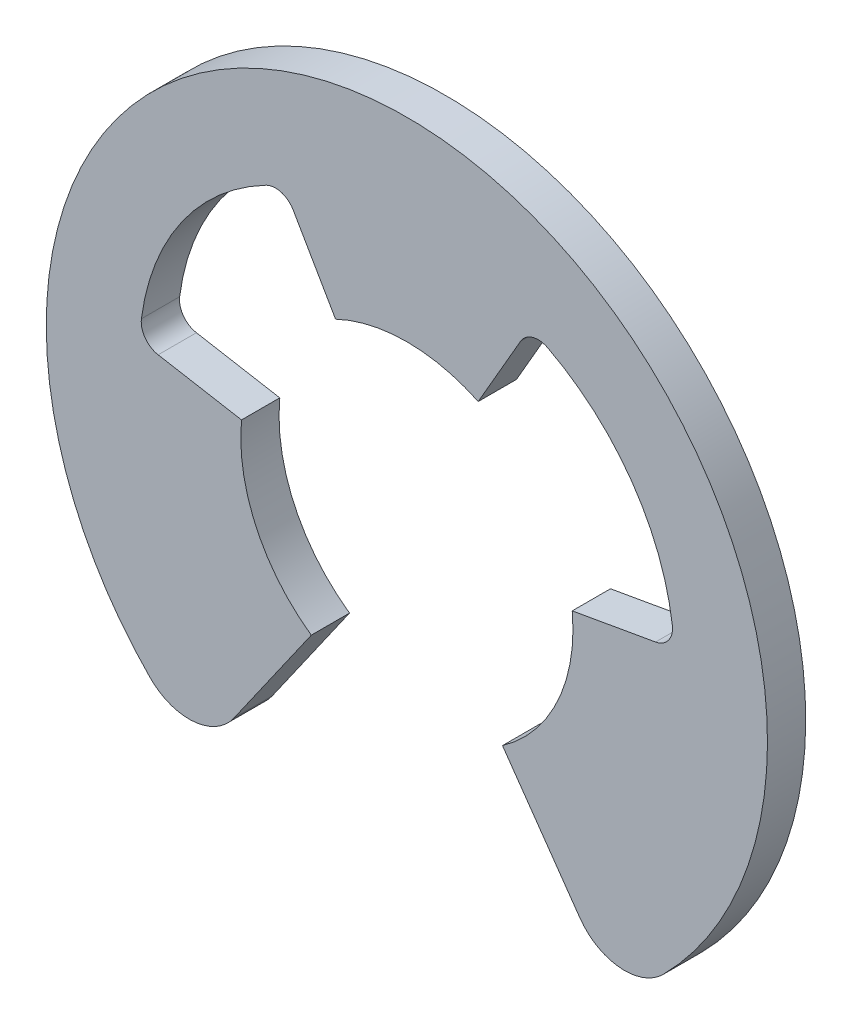
ISO-10303-21;
HEADER;
FILE_DESCRIPTION(('STEP AP214'),'2;1');
FILE_NAME('part.step','',(''),(''),'','','');
FILE_SCHEMA(('AUTOMOTIVE_DESIGN { 1 0 10303 214 1 1 1 1 }'));
ENDSEC;
DATA;
#1=APPLICATION_CONTEXT('core data for automotive mechanical design processes');
#2=APPLICATION_PROTOCOL_DEFINITION('international standard','automotive_design',2000,#1);
#3=PRODUCT_CONTEXT('',#1,'mechanical');
#4=PRODUCT('Part','Part','',(#3));
#5=PRODUCT_RELATED_PRODUCT_CATEGORY('part','',(#4));
#6=PRODUCT_DEFINITION_FORMATION('','',#4);
#7=PRODUCT_DEFINITION_CONTEXT('part definition',#1,'design');
#8=PRODUCT_DEFINITION('design','',#6,#7);
#9=PRODUCT_DEFINITION_SHAPE('','',#8);
#10=(LENGTH_UNIT() NAMED_UNIT(*) SI_UNIT(.MILLI.,.METRE.));
#11=(NAMED_UNIT(*) PLANE_ANGLE_UNIT() SI_UNIT($,.RADIAN.));
#12=(NAMED_UNIT(*) SI_UNIT($,.STERADIAN.) SOLID_ANGLE_UNIT());
#13=UNCERTAINTY_MEASURE_WITH_UNIT(LENGTH_MEASURE(1.E-05),#10,'distance_accuracy_value','');
#14=(GEOMETRIC_REPRESENTATION_CONTEXT(3) GLOBAL_UNCERTAINTY_ASSIGNED_CONTEXT((#13)) GLOBAL_UNIT_ASSIGNED_CONTEXT((#10,
#11,#12)) REPRESENTATION_CONTEXT('',''));
#15=CARTESIAN_POINT('',(0.,0.,0.));
#16=DIRECTION('',(0.,0.,1.));
#17=DIRECTION('',(1.,0.,0.));
#18=AXIS2_PLACEMENT_3D('',#15,#16,#17);
#19=CARTESIAN_POINT('',(0.,0.950568792696658,-0.4445));
#20=DIRECTION('',(0.,0.,1.));
#21=DIRECTION('',(1.,0.,0.));
#22=AXIS2_PLACEMENT_3D('',#19,#20,#21);
#23=PLANE('',#22);
#24=DIRECTION('',(0.573576436351046,0.819152044288992,0.));
#25=VECTOR('',#24,1.);
#26=CARTESIAN_POINT('',(-4.0207262583221,-5.72507328235155,-0.4445));
#27=LINE('',#26,#25);
#28=CARTESIAN_POINT('',(-4.0207262583221,-5.72507328235155,-0.4445));
#29=VERTEX_POINT('',#28);
#30=CARTESIAN_POINT('',(-2.2225,-3.15694003585751,-0.4445));
#31=VERTEX_POINT('',#30);
#32=EDGE_CURVE('E150',#29,#31,#27,.T.);
#33=ORIENTED_EDGE('',*,*,#32,.F.);
#34=CARTESIAN_POINT('',(-5.06104935456912,-4.99663120818572,-0.4445));
#35=DIRECTION('',(0.,0.,1.));
#36=DIRECTION('',(1.,0.,0.));
#37=AXIS2_PLACEMENT_3D('',#34,#35,#36);
#38=CIRCLE('',#37,1.27);
#39=CARTESIAN_POINT('',(-5.96480816788504,-5.88888678107603,-0.4445));
#40=VERTEX_POINT('',#39);
#41=EDGE_CURVE('E34',#40,#29,#38,.T.);
#42=ORIENTED_EDGE('',*,*,#41,.F.);
#43=CARTESIAN_POINT('',(0.,0.,-0.4445));
#44=DIRECTION('',(0.,0.,1.));
#45=DIRECTION('',(1.,0.,0.));
#46=AXIS2_PLACEMENT_3D('',#43,#44,#45);
#47=CIRCLE('',#46,8.382);
#48=CARTESIAN_POINT('',(5.96480816788504,-5.88888678107603,-0.4445));
#49=VERTEX_POINT('',#48);
#50=EDGE_CURVE('E25',#49,#40,#47,.T.);
#51=ORIENTED_EDGE('',*,*,#50,.F.);
#52=CARTESIAN_POINT('',(5.06104935456912,-4.99663120818572,-0.4445));
#53=DIRECTION('',(0.,0.,1.));
#54=DIRECTION('',(1.,0.,0.));
#55=AXIS2_PLACEMENT_3D('',#52,#53,#54);
#56=CIRCLE('',#55,1.27);
#57=CARTESIAN_POINT('',(4.0207262583221,-5.72507328235155,-0.4445));
#58=VERTEX_POINT('',#57);
#59=EDGE_CURVE('E165',#58,#49,#56,.T.);
#60=ORIENTED_EDGE('',*,*,#59,.F.);
#61=DIRECTION('',(0.573576436351046,-0.819152044288992,0.));
#62=VECTOR('',#61,1.);
#63=CARTESIAN_POINT('',(2.2225,-3.15694003585751,-0.4445));
#64=LINE('',#63,#62);
#65=CARTESIAN_POINT('',(2.2225,-3.15694003585751,-0.4445));
#66=VERTEX_POINT('',#65);
#67=EDGE_CURVE('E168',#66,#58,#64,.T.);
#68=ORIENTED_EDGE('',*,*,#67,.F.);
#69=CARTESIAN_POINT('',(0.,0.,-0.4445));
#70=DIRECTION('',(0.,0.,-1.));
#71=DIRECTION('',(0.,-1.,0.));
#72=AXIS2_PLACEMENT_3D('',#69,#70,#71);
#73=CIRCLE('',#72,3.8608);
#74=CARTESIAN_POINT('',(3.84344734962157,0.365635215326578,-0.4445));
#75=VERTEX_POINT('',#74);
#76=EDGE_CURVE('E175',#75,#66,#73,.T.);
#77=ORIENTED_EDGE('',*,*,#76,.F.);
#78=DIRECTION('',(-0.984807753012208,-0.17364817766693,0.));
#79=VECTOR('',#78,1.);
#80=CARTESIAN_POINT('',(5.78121413777015,0.707315782397956,-0.4445));
#81=LINE('',#80,#79);
#82=CARTESIAN_POINT('',(5.78121413777015,0.707315782397956,-0.4445));
#83=VERTEX_POINT('',#82);
#84=EDGE_CURVE('E181',#83,#75,#81,.T.);
#85=ORIENTED_EDGE('',*,*,#84,.F.);
#86=CARTESIAN_POINT('',(5.69851419315628,1.17633047477002,-0.4445));
#87=DIRECTION('',(0.,0.,-1.));
#88=DIRECTION('',(0.,-1.,0.));
#89=AXIS2_PLACEMENT_3D('',#86,#87,#88);
#90=CIRCLE('',#89,0.476249999999999);
#91=CARTESIAN_POINT('',(6.17073522176454,1.23814764584856,-0.4445));
#92=VERTEX_POINT('',#91);
#93=EDGE_CURVE('E187',#92,#83,#90,.T.);
#94=ORIENTED_EDGE('',*,*,#93,.F.);
#95=CARTESIAN_POINT('',(0.755934093723117,0.529310750814651,-0.4445));
#96=DIRECTION('',(0.,0.,-1.));
#97=DIRECTION('',(0.,-1.,0.));
#98=AXIS2_PLACEMENT_3D('',#95,#96,#97);
#99=CIRCLE('',#98,5.461);
#100=CARTESIAN_POINT('',(3.27399395122,5.37512291742437,-0.4445));
#101=VERTEX_POINT('',#100);
#102=EDGE_CURVE('E193',#101,#92,#99,.T.);
#103=ORIENTED_EDGE('',*,*,#102,.F.);
#104=CARTESIAN_POINT('',(3.05439570783364,4.95252301917352,-0.4445));
#105=DIRECTION('',(0.,0.,-1.));
#106=DIRECTION('',(0.,-1.,0.));
#107=AXIS2_PLACEMENT_3D('',#104,#105,#106);
#108=CIRCLE('',#107,0.476249999999997);
#109=CARTESIAN_POINT('',(2.6419511092813,5.19064801917352,-0.4445));
#110=VERTEX_POINT('',#109);
#111=EDGE_CURVE('E199',#110,#101,#108,.T.);
#112=ORIENTED_EDGE('',*,*,#111,.F.);
#113=DIRECTION('',(0.5,0.866025403784438,0.));
#114=VECTOR('',#113,1.);
#115=CARTESIAN_POINT('',(1.65812112712408,3.48660450406764,-0.4445));
#116=LINE('',#115,#114);
#117=CARTESIAN_POINT('',(1.65812112712408,3.48660450406764,-0.4445));
#118=VERTEX_POINT('',#117);
#119=EDGE_CURVE('E205',#118,#110,#116,.T.);
#120=ORIENTED_EDGE('',*,*,#119,.F.);
#121=CARTESIAN_POINT('',(0.,0.,-0.4445));
#122=DIRECTION('',(0.,0.,-1.));
#123=DIRECTION('',(0.,-1.,0.));
#124=AXIS2_PLACEMENT_3D('',#121,#122,#123);
#125=CIRCLE('',#124,3.8608);
#126=CARTESIAN_POINT('',(-1.65812112712408,3.48660450406764,-0.4445));
#127=VERTEX_POINT('',#126);
#128=EDGE_CURVE('E211',#127,#118,#125,.T.);
#129=ORIENTED_EDGE('',*,*,#128,.F.);
#130=DIRECTION('',(0.5,-0.866025403784438,0.));
#131=VECTOR('',#130,1.);
#132=CARTESIAN_POINT('',(-2.6419511092813,5.19064801917352,-0.4445));
#133=LINE('',#132,#131);
#134=CARTESIAN_POINT('',(-2.6419511092813,5.19064801917352,-0.4445));
#135=VERTEX_POINT('',#134);
#136=EDGE_CURVE('E217',#135,#127,#133,.T.);
#137=ORIENTED_EDGE('',*,*,#136,.F.);
#138=CARTESIAN_POINT('',(-3.05439570783364,4.95252301917352,-0.4445));
#139=DIRECTION('',(0.,0.,-1.));
#140=DIRECTION('',(0.,-1.,0.));
#141=AXIS2_PLACEMENT_3D('',#138,#139,#140);
#142=CIRCLE('',#141,0.476250000000001);
#143=CARTESIAN_POINT('',(-3.27399395122,5.37512291742437,-0.4445));
#144=VERTEX_POINT('',#143);
#145=EDGE_CURVE('E223',#144,#135,#142,.T.);
#146=ORIENTED_EDGE('',*,*,#145,.F.);
#147=CARTESIAN_POINT('',(-0.755934093723116,0.529310750814652,-0.4445));
#148=DIRECTION('',(0.,0.,-1.));
#149=DIRECTION('',(0.,-1.,0.));
#150=AXIS2_PLACEMENT_3D('',#147,#148,#149);
#151=CIRCLE('',#150,5.461);
#152=CARTESIAN_POINT('',(-6.17073522176454,1.23814764584857,-0.4445));
#153=VERTEX_POINT('',#152);
#154=EDGE_CURVE('E229',#153,#144,#151,.T.);
#155=ORIENTED_EDGE('',*,*,#154,.F.);
#156=CARTESIAN_POINT('',(-5.69851419315628,1.17633047477003,-0.4445));
#157=DIRECTION('',(0.,0.,-1.));
#158=DIRECTION('',(0.,-1.,0.));
#159=AXIS2_PLACEMENT_3D('',#156,#157,#158);
#160=CIRCLE('',#159,0.47625);
#161=CARTESIAN_POINT('',(-5.78121413777015,0.707315782397964,-0.4445));
#162=VERTEX_POINT('',#161);
#163=EDGE_CURVE('E235',#162,#153,#160,.T.);
#164=ORIENTED_EDGE('',*,*,#163,.F.);
#165=DIRECTION('',(-0.984807753012208,0.173648177666932,0.));
#166=VECTOR('',#165,1.);
#167=CARTESIAN_POINT('',(-3.84344734962157,0.365635215326582,-0.4445));
#168=LINE('',#167,#166);
#169=CARTESIAN_POINT('',(-3.84344734962157,0.365635215326582,-0.4445));
#170=VERTEX_POINT('',#169);
#171=EDGE_CURVE('E241',#170,#162,#168,.T.);
#172=ORIENTED_EDGE('',*,*,#171,.F.);
#173=CARTESIAN_POINT('',(0.,0.,-0.4445));
#174=DIRECTION('',(0.,0.,-1.));
#175=DIRECTION('',(0.,-1.,0.));
#176=AXIS2_PLACEMENT_3D('',#173,#174,#175);
#177=CIRCLE('',#176,3.8608);
#178=EDGE_CURVE('E246',#31,#170,#177,.T.);
#179=ORIENTED_EDGE('',*,*,#178,.F.);
#180=EDGE_LOOP('',(#33,#42,#51,#60,#68,#77,#85,#94,#103,#112,#120,#129,#137,#146,#155,#164,#172,#179));
#181=FACE_BOUND('',#180,.T.);
#182=ADVANCED_FACE('F15',(#181),#23,.F.);
#183=CARTESIAN_POINT('',(0.,0.,0.));
#184=DIRECTION('',(0.,0.,1.));
#185=DIRECTION('',(1.,0.,0.));
#186=AXIS2_PLACEMENT_3D('',#183,#184,#185);
#187=CYLINDRICAL_SURFACE('',#186,8.382);
#188=CARTESIAN_POINT('',(0.,0.,0.4445));
#189=DIRECTION('',(0.,0.,-1.));
#190=DIRECTION('',(0.,-1.,0.));
#191=AXIS2_PLACEMENT_3D('',#188,#189,#190);
#192=CIRCLE('',#191,8.382);
#193=CARTESIAN_POINT('',(-5.96480816788504,-5.88888678107603,0.4445));
#194=VERTEX_POINT('',#193);
#195=CARTESIAN_POINT('',(5.96480816788504,-5.88888678107603,0.4445));
#196=VERTEX_POINT('',#195);
#197=EDGE_CURVE('E9',#194,#196,#192,.T.);
#198=ORIENTED_EDGE('',*,*,#197,.T.);
#199=DIRECTION('',(0.,0.,1.));
#200=VECTOR('',#199,1.);
#201=CARTESIAN_POINT('',(5.96480816788504,-5.88888678107603,0.));
#202=LINE('',#201,#200);
#203=EDGE_CURVE('E161',#49,#196,#202,.T.);
#204=ORIENTED_EDGE('',*,*,#203,.F.);
#205=ORIENTED_EDGE('',*,*,#50,.T.);
#206=DIRECTION('',(0.,0.,-1.));
#207=VECTOR('',#206,1.);
#208=CARTESIAN_POINT('',(-5.96480816788504,-5.88888678107603,0.));
#209=LINE('',#208,#207);
#210=EDGE_CURVE('E155',#194,#40,#209,.T.);
#211=ORIENTED_EDGE('',*,*,#210,.F.);
#212=EDGE_LOOP('',(#198,#204,#205,#211));
#213=FACE_BOUND('',#212,.T.);
#214=ADVANCED_FACE('F285',(#213),#187,.T.);
#215=CARTESIAN_POINT('',(5.06104935456912,-4.99663120818572,0.));
#216=DIRECTION('',(0.,0.,1.));
#217=DIRECTION('',(1.,0.,0.));
#218=AXIS2_PLACEMENT_3D('',#215,#216,#217);
#219=CYLINDRICAL_SURFACE('',#218,1.27);
#220=CARTESIAN_POINT('',(5.06104935456912,-4.99663120818572,0.4445));
#221=DIRECTION('',(0.,0.,-1.));
#222=DIRECTION('',(0.,-1.,0.));
#223=AXIS2_PLACEMENT_3D('',#220,#221,#222);
#224=CIRCLE('',#223,1.27);
#225=CARTESIAN_POINT('',(4.0207262583221,-5.72507328235155,0.4445));
#226=VERTEX_POINT('',#225);
#227=EDGE_CURVE('E162',#196,#226,#224,.T.);
#228=ORIENTED_EDGE('',*,*,#227,.T.);
#229=DIRECTION('',(0.,0.,1.));
#230=VECTOR('',#229,1.);
#231=CARTESIAN_POINT('',(4.0207262583221,-5.72507328235155,0.));
#232=LINE('',#231,#230);
#233=EDGE_CURVE('E166',#58,#226,#232,.T.);
#234=ORIENTED_EDGE('',*,*,#233,.F.);
#235=ORIENTED_EDGE('',*,*,#59,.T.);
#236=ORIENTED_EDGE('',*,*,#203,.T.);
#237=EDGE_LOOP('',(#228,#234,#235,#236));
#238=FACE_BOUND('',#237,.T.);
#239=ADVANCED_FACE('F290',(#238),#219,.T.);
#240=CARTESIAN_POINT('',(4.0207262583221,-5.72507328235155,0.));
#241=DIRECTION('',(-0.819152044288992,-0.573576436351046,0.));
#242=DIRECTION('',(0.573576436351046,-0.819152044288992,0.));
#243=AXIS2_PLACEMENT_3D('',#240,#241,#242);
#244=PLANE('',#243);
#245=DIRECTION('',(-0.573576436351046,0.819152044288992,0.));
#246=VECTOR('',#245,1.);
#247=CARTESIAN_POINT('',(2.2225,-3.15694003585751,0.4445));
#248=LINE('',#247,#246);
#249=CARTESIAN_POINT('',(2.2225,-3.15694003585751,0.4445));
#250=VERTEX_POINT('',#249);
#251=EDGE_CURVE('E170',#226,#250,#248,.T.);
#252=ORIENTED_EDGE('',*,*,#251,.T.);
#253=DIRECTION('',(0.,0.,1.));
#254=VECTOR('',#253,1.);
#255=CARTESIAN_POINT('',(2.2225,-3.15694003585751,0.));
#256=LINE('',#255,#254);
#257=EDGE_CURVE('E173',#66,#250,#256,.T.);
#258=ORIENTED_EDGE('',*,*,#257,.F.);
#259=ORIENTED_EDGE('',*,*,#67,.T.);
#260=ORIENTED_EDGE('',*,*,#233,.T.);
#261=EDGE_LOOP('',(#252,#258,#259,#260));
#262=FACE_BOUND('',#261,.T.);
#263=ADVANCED_FACE('F294',(#262),#244,.T.);
#264=CARTESIAN_POINT('',(0.,0.,0.));
#265=DIRECTION('',(0.,0.,1.));
#266=DIRECTION('',(1.,0.,0.));
#267=AXIS2_PLACEMENT_3D('',#264,#265,#266);
#268=CYLINDRICAL_SURFACE('',#267,3.8608);
#269=CARTESIAN_POINT('',(0.,0.,0.4445));
#270=DIRECTION('',(0.,0.,1.));
#271=DIRECTION('',(1.,0.,0.));
#272=AXIS2_PLACEMENT_3D('',#269,#270,#271);
#273=CIRCLE('',#272,3.8608);
#274=CARTESIAN_POINT('',(3.84344734962157,0.365635215326578,0.4445));
#275=VERTEX_POINT('',#274);
#276=EDGE_CURVE('E169',#250,#275,#273,.T.);
#277=ORIENTED_EDGE('',*,*,#276,.T.);
#278=DIRECTION('',(0.,0.,1.));
#279=VECTOR('',#278,1.);
#280=CARTESIAN_POINT('',(3.84344734962157,0.365635215326578,0.));
#281=LINE('',#280,#279);
#282=EDGE_CURVE('E179',#75,#275,#281,.T.);
#283=ORIENTED_EDGE('',*,*,#282,.F.);
#284=ORIENTED_EDGE('',*,*,#76,.T.);
#285=ORIENTED_EDGE('',*,*,#257,.T.);
#286=EDGE_LOOP('',(#277,#283,#284,#285));
#287=FACE_BOUND('',#286,.T.);
#288=ADVANCED_FACE('F297',(#287),#268,.F.);
#289=CARTESIAN_POINT('',(3.84344734962157,0.365635215326578,0.));
#290=DIRECTION('',(-0.17364817766693,0.984807753012208,0.));
#291=DIRECTION('',(-0.984807753012208,-0.17364817766693,0.));
#292=AXIS2_PLACEMENT_3D('',#289,#290,#291);
#293=PLANE('',#292);
#294=DIRECTION('',(0.984807753012208,0.17364817766693,0.));
#295=VECTOR('',#294,1.);
#296=CARTESIAN_POINT('',(5.78121413777015,0.707315782397956,0.4445));
#297=LINE('',#296,#295);
#298=CARTESIAN_POINT('',(5.78121413777015,0.707315782397956,0.4445));
#299=VERTEX_POINT('',#298);
#300=EDGE_CURVE('E176',#275,#299,#297,.T.);
#301=ORIENTED_EDGE('',*,*,#300,.T.);
#302=DIRECTION('',(0.,0.,1.));
#303=VECTOR('',#302,1.);
#304=CARTESIAN_POINT('',(5.78121413777015,0.707315782397956,0.));
#305=LINE('',#304,#303);
#306=EDGE_CURVE('E185',#83,#299,#305,.T.);
#307=ORIENTED_EDGE('',*,*,#306,.F.);
#308=ORIENTED_EDGE('',*,*,#84,.T.);
#309=ORIENTED_EDGE('',*,*,#282,.T.);
#310=EDGE_LOOP('',(#301,#307,#308,#309));
#311=FACE_BOUND('',#310,.T.);
#312=ADVANCED_FACE('F299',(#311),#293,.T.);
#313=CARTESIAN_POINT('',(5.69851419315628,1.17633047477002,0.));
#314=DIRECTION('',(0.,0.,1.));
#315=DIRECTION('',(1.,0.,0.));
#316=AXIS2_PLACEMENT_3D('',#313,#314,#315);
#317=CYLINDRICAL_SURFACE('',#316,0.476249999999999);
#318=CARTESIAN_POINT('',(5.69851419315628,1.17633047477002,0.4445));
#319=DIRECTION('',(0.,0.,1.));
#320=DIRECTION('',(1.,0.,0.));
#321=AXIS2_PLACEMENT_3D('',#318,#319,#320);
#322=CIRCLE('',#321,0.476249999999999);
#323=CARTESIAN_POINT('',(6.17073522176454,1.23814764584856,0.4445));
#324=VERTEX_POINT('',#323);
#325=EDGE_CURVE('E182',#299,#324,#322,.T.);
#326=ORIENTED_EDGE('',*,*,#325,.T.);
#327=DIRECTION('',(0.,0.,1.));
#328=VECTOR('',#327,1.);
#329=CARTESIAN_POINT('',(6.17073522176454,1.23814764584856,0.));
#330=LINE('',#329,#328);
#331=EDGE_CURVE('E191',#92,#324,#330,.T.);
#332=ORIENTED_EDGE('',*,*,#331,.F.);
#333=ORIENTED_EDGE('',*,*,#93,.T.);
#334=ORIENTED_EDGE('',*,*,#306,.T.);
#335=EDGE_LOOP('',(#326,#332,#333,#334));
#336=FACE_BOUND('',#335,.T.);
#337=ADVANCED_FACE('F302',(#336),#317,.F.);
#338=CARTESIAN_POINT('',(0.755934093723117,0.529310750814651,0.));
#339=DIRECTION('',(0.,0.,1.));
#340=DIRECTION('',(1.,0.,0.));
#341=AXIS2_PLACEMENT_3D('',#338,#339,#340);
#342=CYLINDRICAL_SURFACE('',#341,5.461);
#343=CARTESIAN_POINT('',(0.755934093723117,0.529310750814651,0.4445));
#344=DIRECTION('',(0.,0.,1.));
#345=DIRECTION('',(1.,0.,0.));
#346=AXIS2_PLACEMENT_3D('',#343,#344,#345);
#347=CIRCLE('',#346,5.461);
#348=CARTESIAN_POINT('',(3.27399395122,5.37512291742437,0.4445));
#349=VERTEX_POINT('',#348);
#350=EDGE_CURVE('E188',#324,#349,#347,.T.);
#351=ORIENTED_EDGE('',*,*,#350,.T.);
#352=DIRECTION('',(0.,0.,1.));
#353=VECTOR('',#352,1.);
#354=CARTESIAN_POINT('',(3.27399395122,5.37512291742437,0.));
#355=LINE('',#354,#353);
#356=EDGE_CURVE('E197',#101,#349,#355,.T.);
#357=ORIENTED_EDGE('',*,*,#356,.F.);
#358=ORIENTED_EDGE('',*,*,#102,.T.);
#359=ORIENTED_EDGE('',*,*,#331,.T.);
#360=EDGE_LOOP('',(#351,#357,#358,#359));
#361=FACE_BOUND('',#360,.T.);
#362=ADVANCED_FACE('F325',(#361),#342,.F.);
#363=CARTESIAN_POINT('',(3.05439570783364,4.95252301917352,0.));
#364=DIRECTION('',(0.,0.,1.));
#365=DIRECTION('',(1.,0.,0.));
#366=AXIS2_PLACEMENT_3D('',#363,#364,#365);
#367=CYLINDRICAL_SURFACE('',#366,0.476249999999997);
#368=CARTESIAN_POINT('',(3.05439570783364,4.95252301917352,0.4445));
#369=DIRECTION('',(0.,0.,1.));
#370=DIRECTION('',(1.,0.,0.));
#371=AXIS2_PLACEMENT_3D('',#368,#369,#370);
#372=CIRCLE('',#371,0.476249999999997);
#373=CARTESIAN_POINT('',(2.6419511092813,5.19064801917352,0.4445));
#374=VERTEX_POINT('',#373);
#375=EDGE_CURVE('E194',#349,#374,#372,.T.);
#376=ORIENTED_EDGE('',*,*,#375,.T.);
#377=DIRECTION('',(0.,0.,1.));
#378=VECTOR('',#377,1.);
#379=CARTESIAN_POINT('',(2.6419511092813,5.19064801917352,0.));
#380=LINE('',#379,#378);
#381=EDGE_CURVE('E203',#110,#374,#380,.T.);
#382=ORIENTED_EDGE('',*,*,#381,.F.);
#383=ORIENTED_EDGE('',*,*,#111,.T.);
#384=ORIENTED_EDGE('',*,*,#356,.T.);
#385=EDGE_LOOP('',(#376,#382,#383,#384));
#386=FACE_BOUND('',#385,.T.);
#387=ADVANCED_FACE('F308',(#386),#367,.F.);
#388=CARTESIAN_POINT('',(2.6419511092813,5.19064801917352,0.));
#389=DIRECTION('',(0.866025403784438,-0.5,0.));
#390=DIRECTION('',(0.5,0.866025403784438,0.));
#391=AXIS2_PLACEMENT_3D('',#388,#389,#390);
#392=PLANE('',#391);
#393=DIRECTION('',(-0.5,-0.866025403784438,0.));
#394=VECTOR('',#393,1.);
#395=CARTESIAN_POINT('',(1.65812112712408,3.48660450406764,0.4445));
#396=LINE('',#395,#394);
#397=CARTESIAN_POINT('',(1.65812112712408,3.48660450406764,0.4445));
#398=VERTEX_POINT('',#397);
#399=EDGE_CURVE('E200',#374,#398,#396,.T.);
#400=ORIENTED_EDGE('',*,*,#399,.T.);
#401=DIRECTION('',(0.,0.,1.));
#402=VECTOR('',#401,1.);
#403=CARTESIAN_POINT('',(1.65812112712408,3.48660450406764,0.));
#404=LINE('',#403,#402);
#405=EDGE_CURVE('E209',#118,#398,#404,.T.);
#406=ORIENTED_EDGE('',*,*,#405,.F.);
#407=ORIENTED_EDGE('',*,*,#119,.T.);
#408=ORIENTED_EDGE('',*,*,#381,.T.);
#409=EDGE_LOOP('',(#400,#406,#407,#408));
#410=FACE_BOUND('',#409,.T.);
#411=ADVANCED_FACE('F304',(#410),#392,.T.);
#412=CARTESIAN_POINT('',(0.,0.,0.));
#413=DIRECTION('',(0.,0.,1.));
#414=DIRECTION('',(1.,0.,0.));
#415=AXIS2_PLACEMENT_3D('',#412,#413,#414);
#416=CYLINDRICAL_SURFACE('',#415,3.8608);
#417=CARTESIAN_POINT('',(0.,0.,0.4445));
#418=DIRECTION('',(0.,0.,1.));
#419=DIRECTION('',(1.,0.,0.));
#420=AXIS2_PLACEMENT_3D('',#417,#418,#419);
#421=CIRCLE('',#420,3.8608);
#422=CARTESIAN_POINT('',(-1.65812112712408,3.48660450406764,0.4445));
#423=VERTEX_POINT('',#422);
#424=EDGE_CURVE('E206',#398,#423,#421,.T.);
#425=ORIENTED_EDGE('',*,*,#424,.T.);
#426=DIRECTION('',(0.,0.,1.));
#427=VECTOR('',#426,1.);
#428=CARTESIAN_POINT('',(-1.65812112712408,3.48660450406764,0.));
#429=LINE('',#428,#427);
#430=EDGE_CURVE('E215',#127,#423,#429,.T.);
#431=ORIENTED_EDGE('',*,*,#430,.F.);
#432=ORIENTED_EDGE('',*,*,#128,.T.);
#433=ORIENTED_EDGE('',*,*,#405,.T.);
#434=EDGE_LOOP('',(#425,#431,#432,#433));
#435=FACE_BOUND('',#434,.T.);
#436=ADVANCED_FACE('F307',(#435),#416,.F.);
#437=CARTESIAN_POINT('',(-1.65812112712408,3.48660450406764,0.));
#438=DIRECTION('',(-0.866025403784438,-0.5,0.));
#439=DIRECTION('',(0.5,-0.866025403784438,0.));
#440=AXIS2_PLACEMENT_3D('',#437,#438,#439);
#441=PLANE('',#440);
#442=DIRECTION('',(-0.5,0.866025403784438,0.));
#443=VECTOR('',#442,1.);
#444=CARTESIAN_POINT('',(-2.6419511092813,5.19064801917352,0.4445));
#445=LINE('',#444,#443);
#446=CARTESIAN_POINT('',(-2.6419511092813,5.19064801917352,0.4445));
#447=VERTEX_POINT('',#446);
#448=EDGE_CURVE('E212',#423,#447,#445,.T.);
#449=ORIENTED_EDGE('',*,*,#448,.T.);
#450=DIRECTION('',(0.,0.,1.));
#451=VECTOR('',#450,1.);
#452=CARTESIAN_POINT('',(-2.6419511092813,5.19064801917352,0.));
#453=LINE('',#452,#451);
#454=EDGE_CURVE('E221',#135,#447,#453,.T.);
#455=ORIENTED_EDGE('',*,*,#454,.F.);
#456=ORIENTED_EDGE('',*,*,#136,.T.);
#457=ORIENTED_EDGE('',*,*,#430,.T.);
#458=EDGE_LOOP('',(#449,#455,#456,#457));
#459=FACE_BOUND('',#458,.T.);
#460=ADVANCED_FACE('F310',(#459),#441,.T.);
#461=CARTESIAN_POINT('',(-3.05439570783364,4.95252301917352,0.));
#462=DIRECTION('',(0.,0.,1.));
#463=DIRECTION('',(1.,0.,0.));
#464=AXIS2_PLACEMENT_3D('',#461,#462,#463);
#465=CYLINDRICAL_SURFACE('',#464,0.476250000000001);
#466=CARTESIAN_POINT('',(-3.05439570783364,4.95252301917352,0.4445));
#467=DIRECTION('',(0.,0.,1.));
#468=DIRECTION('',(1.,0.,0.));
#469=AXIS2_PLACEMENT_3D('',#466,#467,#468);
#470=CIRCLE('',#469,0.476250000000001);
#471=CARTESIAN_POINT('',(-3.27399395122,5.37512291742437,0.4445));
#472=VERTEX_POINT('',#471);
#473=EDGE_CURVE('E218',#447,#472,#470,.T.);
#474=ORIENTED_EDGE('',*,*,#473,.T.);
#475=DIRECTION('',(0.,0.,1.));
#476=VECTOR('',#475,1.);
#477=CARTESIAN_POINT('',(-3.27399395122,5.37512291742437,0.));
#478=LINE('',#477,#476);
#479=EDGE_CURVE('E227',#144,#472,#478,.T.);
#480=ORIENTED_EDGE('',*,*,#479,.F.);
#481=ORIENTED_EDGE('',*,*,#145,.T.);
#482=ORIENTED_EDGE('',*,*,#454,.T.);
#483=EDGE_LOOP('',(#474,#480,#481,#482));
#484=FACE_BOUND('',#483,.T.);
#485=ADVANCED_FACE('F312',(#484),#465,.F.);
#486=CARTESIAN_POINT('',(-0.755934093723116,0.529310750814652,0.));
#487=DIRECTION('',(0.,0.,1.));
#488=DIRECTION('',(1.,0.,0.));
#489=AXIS2_PLACEMENT_3D('',#486,#487,#488);
#490=CYLINDRICAL_SURFACE('',#489,5.461);
#491=CARTESIAN_POINT('',(-0.755934093723116,0.529310750814652,0.4445));
#492=DIRECTION('',(0.,0.,1.));
#493=DIRECTION('',(1.,0.,0.));
#494=AXIS2_PLACEMENT_3D('',#491,#492,#493);
#495=CIRCLE('',#494,5.461);
#496=CARTESIAN_POINT('',(-6.17073522176454,1.23814764584857,0.4445));
#497=VERTEX_POINT('',#496);
#498=EDGE_CURVE('E224',#472,#497,#495,.T.);
#499=ORIENTED_EDGE('',*,*,#498,.T.);
#500=DIRECTION('',(0.,0.,1.));
#501=VECTOR('',#500,1.);
#502=CARTESIAN_POINT('',(-6.17073522176454,1.23814764584857,0.));
#503=LINE('',#502,#501);
#504=EDGE_CURVE('E233',#153,#497,#503,.T.);
#505=ORIENTED_EDGE('',*,*,#504,.F.);
#506=ORIENTED_EDGE('',*,*,#154,.T.);
#507=ORIENTED_EDGE('',*,*,#479,.T.);
#508=EDGE_LOOP('',(#499,#505,#506,#507));
#509=FACE_BOUND('',#508,.T.);
#510=ADVANCED_FACE('F338',(#509),#490,.F.);
#511=CARTESIAN_POINT('',(-5.69851419315628,1.17633047477003,0.));
#512=DIRECTION('',(0.,0.,1.));
#513=DIRECTION('',(1.,0.,0.));
#514=AXIS2_PLACEMENT_3D('',#511,#512,#513);
#515=CYLINDRICAL_SURFACE('',#514,0.47625);
#516=CARTESIAN_POINT('',(-5.69851419315628,1.17633047477003,0.4445));
#517=DIRECTION('',(0.,0.,1.));
#518=DIRECTION('',(1.,0.,0.));
#519=AXIS2_PLACEMENT_3D('',#516,#517,#518);
#520=CIRCLE('',#519,0.47625);
#521=CARTESIAN_POINT('',(-5.78121413777015,0.707315782397964,0.4445));
#522=VERTEX_POINT('',#521);
#523=EDGE_CURVE('E230',#497,#522,#520,.T.);
#524=ORIENTED_EDGE('',*,*,#523,.T.);
#525=DIRECTION('',(0.,0.,1.));
#526=VECTOR('',#525,1.);
#527=CARTESIAN_POINT('',(-5.78121413777015,0.707315782397964,0.));
#528=LINE('',#527,#526);
#529=EDGE_CURVE('E239',#162,#522,#528,.T.);
#530=ORIENTED_EDGE('',*,*,#529,.F.);
#531=ORIENTED_EDGE('',*,*,#163,.T.);
#532=ORIENTED_EDGE('',*,*,#504,.T.);
#533=EDGE_LOOP('',(#524,#530,#531,#532));
#534=FACE_BOUND('',#533,.T.);
#535=ADVANCED_FACE('F280',(#534),#515,.F.);
#536=CARTESIAN_POINT('',(-5.78121413777015,0.707315782397964,0.));
#537=DIRECTION('',(0.173648177666932,0.984807753012208,0.));
#538=DIRECTION('',(-0.984807753012208,0.173648177666932,0.));
#539=AXIS2_PLACEMENT_3D('',#536,#537,#538);
#540=PLANE('',#539);
#541=DIRECTION('',(0.984807753012208,-0.173648177666932,0.));
#542=VECTOR('',#541,1.);
#543=CARTESIAN_POINT('',(-3.84344734962157,0.365635215326582,0.4445));
#544=LINE('',#543,#542);
#545=CARTESIAN_POINT('',(-3.84344734962157,0.365635215326582,0.4445));
#546=VERTEX_POINT('',#545);
#547=EDGE_CURVE('E236',#522,#546,#544,.T.);
#548=ORIENTED_EDGE('',*,*,#547,.T.);
#549=DIRECTION('',(0.,0.,1.));
#550=VECTOR('',#549,1.);
#551=CARTESIAN_POINT('',(-3.84344734962157,0.365635215326582,0.));
#552=LINE('',#551,#550);
#553=EDGE_CURVE('E149',#170,#546,#552,.T.);
#554=ORIENTED_EDGE('',*,*,#553,.F.);
#555=ORIENTED_EDGE('',*,*,#171,.T.);
#556=ORIENTED_EDGE('',*,*,#529,.T.);
#557=EDGE_LOOP('',(#548,#554,#555,#556));
#558=FACE_BOUND('',#557,.T.);
#559=ADVANCED_FACE('F273',(#558),#540,.T.);
#560=CARTESIAN_POINT('',(0.,0.,0.));
#561=DIRECTION('',(0.,0.,1.));
#562=DIRECTION('',(1.,0.,0.));
#563=AXIS2_PLACEMENT_3D('',#560,#561,#562);
#564=CYLINDRICAL_SURFACE('',#563,3.8608);
#565=CARTESIAN_POINT('',(0.,0.,0.4445));
#566=DIRECTION('',(0.,0.,1.));
#567=DIRECTION('',(1.,0.,0.));
#568=AXIS2_PLACEMENT_3D('',#565,#566,#567);
#569=CIRCLE('',#568,3.8608);
#570=CARTESIAN_POINT('',(-2.2225,-3.15694003585751,0.4445));
#571=VERTEX_POINT('',#570);
#572=EDGE_CURVE('E242',#546,#571,#569,.T.);
#573=ORIENTED_EDGE('',*,*,#572,.T.);
#574=DIRECTION('',(0.,0.,1.));
#575=VECTOR('',#574,1.);
#576=CARTESIAN_POINT('',(-2.2225,-3.15694003585751,0.));
#577=LINE('',#576,#575);
#578=EDGE_CURVE('E138',#31,#571,#577,.T.);
#579=ORIENTED_EDGE('',*,*,#578,.F.);
#580=ORIENTED_EDGE('',*,*,#178,.T.);
#581=ORIENTED_EDGE('',*,*,#553,.T.);
#582=EDGE_LOOP('',(#573,#579,#580,#581));
#583=FACE_BOUND('',#582,.T.);
#584=ADVANCED_FACE('F271',(#583),#564,.F.);
#585=CARTESIAN_POINT('',(-2.2225,-3.15694003585751,0.));
#586=DIRECTION('',(0.819152044288992,-0.573576436351046,0.));
#587=DIRECTION('',(0.573576436351046,0.819152044288992,0.));
#588=AXIS2_PLACEMENT_3D('',#585,#586,#587);
#589=PLANE('',#588);
#590=DIRECTION('',(-0.573576436351046,-0.819152044288992,0.));
#591=VECTOR('',#590,1.);
#592=CARTESIAN_POINT('',(-4.0207262583221,-5.72507328235155,0.4445));
#593=LINE('',#592,#591);
#594=CARTESIAN_POINT('',(-4.0207262583221,-5.72507328235155,0.4445));
#595=VERTEX_POINT('',#594);
#596=EDGE_CURVE('E145',#571,#595,#593,.T.);
#597=ORIENTED_EDGE('',*,*,#596,.T.);
#598=DIRECTION('',(0.,0.,1.));
#599=VECTOR('',#598,1.);
#600=CARTESIAN_POINT('',(-4.0207262583221,-5.72507328235155,0.));
#601=LINE('',#600,#599);
#602=EDGE_CURVE('E142',#29,#595,#601,.T.);
#603=ORIENTED_EDGE('',*,*,#602,.F.);
#604=ORIENTED_EDGE('',*,*,#32,.T.);
#605=ORIENTED_EDGE('',*,*,#578,.T.);
#606=EDGE_LOOP('',(#597,#603,#604,#605));
#607=FACE_BOUND('',#606,.T.);
#608=ADVANCED_FACE('F146',(#607),#589,.T.);
#609=CARTESIAN_POINT('',(-5.06104935456912,-4.99663120818572,0.));
#610=DIRECTION('',(0.,0.,1.));
#611=DIRECTION('',(1.,0.,0.));
#612=AXIS2_PLACEMENT_3D('',#609,#610,#611);
#613=CYLINDRICAL_SURFACE('',#612,1.27);
#614=CARTESIAN_POINT('',(-5.06104935456912,-4.99663120818572,0.4445));
#615=DIRECTION('',(0.,0.,-1.));
#616=DIRECTION('',(0.,-1.,0.));
#617=AXIS2_PLACEMENT_3D('',#614,#615,#616);
#618=CIRCLE('',#617,1.27);
#619=EDGE_CURVE('E19',#595,#194,#618,.T.);
#620=ORIENTED_EDGE('',*,*,#619,.T.);
#621=ORIENTED_EDGE('',*,*,#210,.T.);
#622=ORIENTED_EDGE('',*,*,#41,.T.);
#623=ORIENTED_EDGE('',*,*,#602,.T.);
#624=EDGE_LOOP('',(#620,#621,#622,#623));
#625=FACE_BOUND('',#624,.T.);
#626=ADVANCED_FACE('F17',(#625),#613,.T.);
#627=CARTESIAN_POINT('',(0.,0.950568792696658,0.4445));
#628=DIRECTION('',(0.,0.,1.));
#629=DIRECTION('',(1.,0.,0.));
#630=AXIS2_PLACEMENT_3D('',#627,#628,#629);
#631=PLANE('',#630);
#632=ORIENTED_EDGE('',*,*,#197,.F.);
#633=ORIENTED_EDGE('',*,*,#619,.F.);
#634=ORIENTED_EDGE('',*,*,#596,.F.);
#635=ORIENTED_EDGE('',*,*,#572,.F.);
#636=ORIENTED_EDGE('',*,*,#547,.F.);
#637=ORIENTED_EDGE('',*,*,#523,.F.);
#638=ORIENTED_EDGE('',*,*,#498,.F.);
#639=ORIENTED_EDGE('',*,*,#473,.F.);
#640=ORIENTED_EDGE('',*,*,#448,.F.);
#641=ORIENTED_EDGE('',*,*,#424,.F.);
#642=ORIENTED_EDGE('',*,*,#399,.F.);
#643=ORIENTED_EDGE('',*,*,#375,.F.);
#644=ORIENTED_EDGE('',*,*,#350,.F.);
#645=ORIENTED_EDGE('',*,*,#325,.F.);
#646=ORIENTED_EDGE('',*,*,#300,.F.);
#647=ORIENTED_EDGE('',*,*,#276,.F.);
#648=ORIENTED_EDGE('',*,*,#251,.F.);
#649=ORIENTED_EDGE('',*,*,#227,.F.);
#650=EDGE_LOOP('',(#632,#633,#634,#635,#636,#637,#638,#639,#640,#641,#642,#643,#644,#645,#646,
#647,#648,#649));
#651=FACE_BOUND('',#650,.T.);
#652=ADVANCED_FACE('F153',(#651),#631,.T.);
#653=CLOSED_SHELL('',(#182,#214,#239,#263,#288,#312,#337,#362,#387,#411,#436,#460,#485,#510,
#535,#559,#584,#608,#626,#652));
#654=MANIFOLD_SOLID_BREP('B1',#653);
#655=ADVANCED_BREP_SHAPE_REPRESENTATION('',(#18,#654),#14);
#656=SHAPE_DEFINITION_REPRESENTATION(#9,#655);
ENDSEC;
END-ISO-10303-21;
